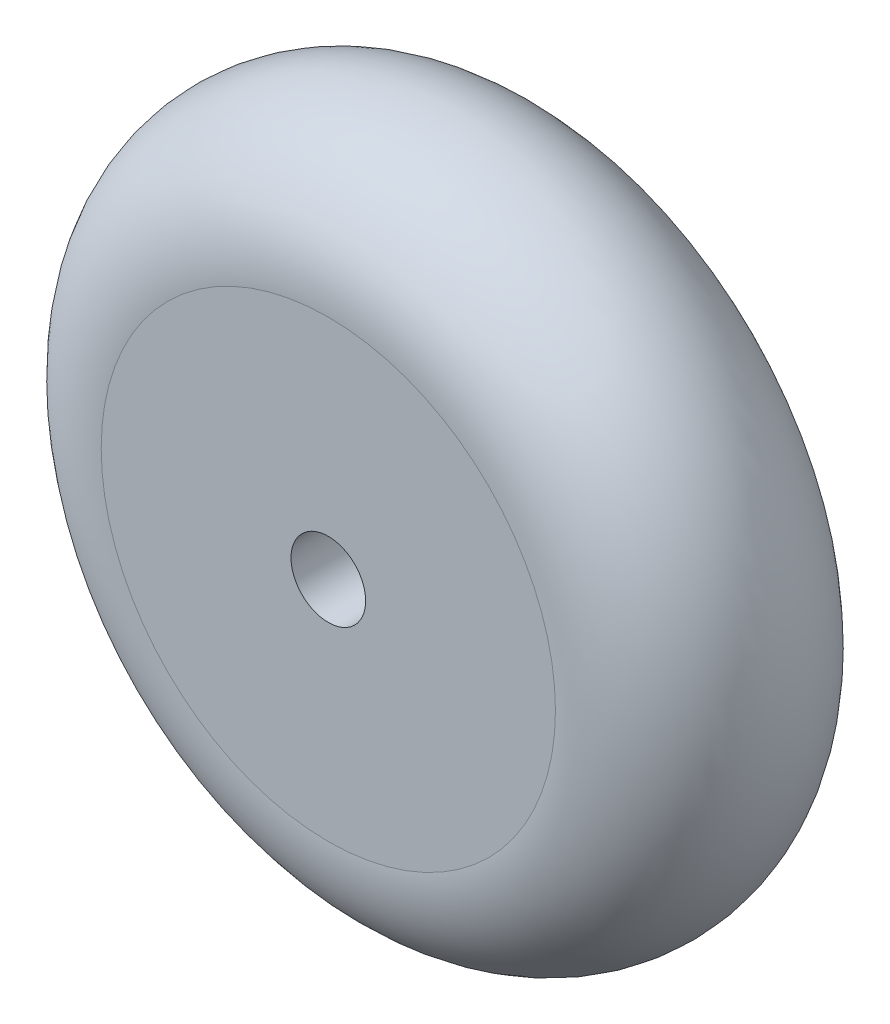
ISO-10303-21;
HEADER;
FILE_DESCRIPTION(('STEP AP214'),'2;1');
FILE_NAME('part.step','',(''),(''),'','','');
FILE_SCHEMA(('AUTOMOTIVE_DESIGN { 1 0 10303 214 1 1 1 1 }'));
ENDSEC;
DATA;
#1=APPLICATION_CONTEXT('core data for automotive mechanical design processes');
#2=APPLICATION_PROTOCOL_DEFINITION('international standard','automotive_design',2000,#1);
#3=PRODUCT_CONTEXT('',#1,'mechanical');
#4=PRODUCT('Part','Part','',(#3));
#5=PRODUCT_RELATED_PRODUCT_CATEGORY('part','',(#4));
#6=PRODUCT_DEFINITION_FORMATION('','',#4);
#7=PRODUCT_DEFINITION_CONTEXT('part definition',#1,'design');
#8=PRODUCT_DEFINITION('design','',#6,#7);
#9=PRODUCT_DEFINITION_SHAPE('','',#8);
#10=(LENGTH_UNIT() NAMED_UNIT(*) SI_UNIT(.MILLI.,.METRE.));
#11=(NAMED_UNIT(*) PLANE_ANGLE_UNIT() SI_UNIT($,.RADIAN.));
#12=(NAMED_UNIT(*) SI_UNIT($,.STERADIAN.) SOLID_ANGLE_UNIT());
#13=UNCERTAINTY_MEASURE_WITH_UNIT(LENGTH_MEASURE(1.E-05),#10,'distance_accuracy_value','');
#14=(GEOMETRIC_REPRESENTATION_CONTEXT(3) GLOBAL_UNCERTAINTY_ASSIGNED_CONTEXT((#13)) GLOBAL_UNIT_ASSIGNED_CONTEXT((#10,
#11,#12)) REPRESENTATION_CONTEXT('',''));
#15=CARTESIAN_POINT('',(0.,0.,0.));
#16=DIRECTION('',(0.,0.,1.));
#17=DIRECTION('',(1.,0.,0.));
#18=AXIS2_PLACEMENT_3D('',#15,#16,#17);
#19=CARTESIAN_POINT('',(-24.3445894384422,0.,0.));
#20=DIRECTION('',(0.,0.,-1.));
#21=DIRECTION('',(-1.,0.,0.));
#22=AXIS2_PLACEMENT_3D('',#19,#20,#21);
#23=PLANE('',#22);
#24=CARTESIAN_POINT('',(0.,0.,0.));
#25=DIRECTION('',(0.,0.,-1.));
#26=DIRECTION('',(-1.,0.,0.));
#27=AXIS2_PLACEMENT_3D('',#24,#25,#26);
#28=CIRCLE('',#27,4.);
#29=CARTESIAN_POINT('',(-4.,0.,0.));
#30=VERTEX_POINT('',#29);
#31=EDGE_CURVE('E44',#30,#30,#28,.T.);
#32=ORIENTED_EDGE('',*,*,#31,.T.);
#33=EDGE_LOOP('',(#32));
#34=FACE_BOUND('',#33,.T.);
#35=CARTESIAN_POINT('',(0.,0.,0.));
#36=DIRECTION('',(0.,0.,1.));
#37=DIRECTION('',(1.,0.,0.));
#38=AXIS2_PLACEMENT_3D('',#35,#36,#37);
#39=CIRCLE('',#38,24.3445894384422);
#40=CARTESIAN_POINT('',(24.3445894384422,0.,0.));
#41=VERTEX_POINT('',#40);
#42=EDGE_CURVE('E40',#41,#41,#39,.T.);
#43=ORIENTED_EDGE('',*,*,#42,.T.);
#44=EDGE_LOOP('',(#43));
#45=FACE_BOUND('',#44,.T.);
#46=ADVANCED_FACE('F34',(#34,#45),#23,.F.);
#47=CARTESIAN_POINT('',(0.,0.,-25.));
#48=DIRECTION('',(0.,0.,1.));
#49=DIRECTION('',(1.,0.,0.));
#50=AXIS2_PLACEMENT_3D('',#47,#48,#49);
#51=PLANE('',#50);
#52=CARTESIAN_POINT('',(0.,0.,-25.));
#53=DIRECTION('',(0.,0.,-1.));
#54=DIRECTION('',(-1.,0.,0.));
#55=AXIS2_PLACEMENT_3D('',#52,#53,#54);
#56=CIRCLE('',#55,4.);
#57=CARTESIAN_POINT('',(-4.,0.,-25.));
#58=VERTEX_POINT('',#57);
#59=EDGE_CURVE('E48',#58,#58,#56,.T.);
#60=ORIENTED_EDGE('',*,*,#59,.F.);
#61=EDGE_LOOP('',(#60));
#62=FACE_BOUND('',#61,.T.);
#63=CARTESIAN_POINT('',(0.,0.,-25.));
#64=DIRECTION('',(0.,0.,1.));
#65=DIRECTION('',(1.,0.,0.));
#66=AXIS2_PLACEMENT_3D('',#63,#64,#65);
#67=CIRCLE('',#66,24.3445894384422);
#68=CARTESIAN_POINT('',(24.3445894384422,0.,-25.));
#69=VERTEX_POINT('',#68);
#70=EDGE_CURVE('E10',#69,#69,#67,.T.);
#71=ORIENTED_EDGE('',*,*,#70,.F.);
#72=EDGE_LOOP('',(#71));
#73=FACE_BOUND('',#72,.T.);
#74=ADVANCED_FACE('F57',(#62,#73),#51,.F.);
#75=CARTESIAN_POINT('',(0.,0.,-12.5));
#76=DIRECTION('',(0.,0.,1.));
#77=DIRECTION('',(1.,0.,0.));
#78=AXIS2_PLACEMENT_3D('',#75,#76,#77);
#79=TOROIDAL_SURFACE('',#78,25.,12.5171707268137);
#80=ORIENTED_EDGE('',*,*,#42,.F.);
#81=EDGE_LOOP('',(#80));
#82=FACE_BOUND('',#81,.T.);
#83=ORIENTED_EDGE('',*,*,#70,.T.);
#84=EDGE_LOOP('',(#83));
#85=FACE_BOUND('',#84,.T.);
#86=ADVANCED_FACE('F60',(#82,#85),#79,.T.);
#87=CARTESIAN_POINT('',(0.,0.,0.0171707268136895));
#88=DIRECTION('',(0.,0.,-1.));
#89=DIRECTION('',(-1.,0.,0.));
#90=AXIS2_PLACEMENT_3D('',#87,#88,#89);
#91=CYLINDRICAL_SURFACE('',#90,4.);
#92=ORIENTED_EDGE('',*,*,#59,.T.);
#93=EDGE_LOOP('',(#92));
#94=FACE_BOUND('',#93,.T.);
#95=ORIENTED_EDGE('',*,*,#31,.F.);
#96=EDGE_LOOP('',(#95));
#97=FACE_BOUND('',#96,.T.);
#98=ADVANCED_FACE('F54',(#94,#97),#91,.F.);
#99=CLOSED_SHELL('',(#46,#74,#86,#98));
#100=MANIFOLD_SOLID_BREP('B2',#99);
#101=ADVANCED_BREP_SHAPE_REPRESENTATION('',(#18,#100),#14);
#102=SHAPE_DEFINITION_REPRESENTATION(#9,#101);
ENDSEC;
END-ISO-10303-21;
